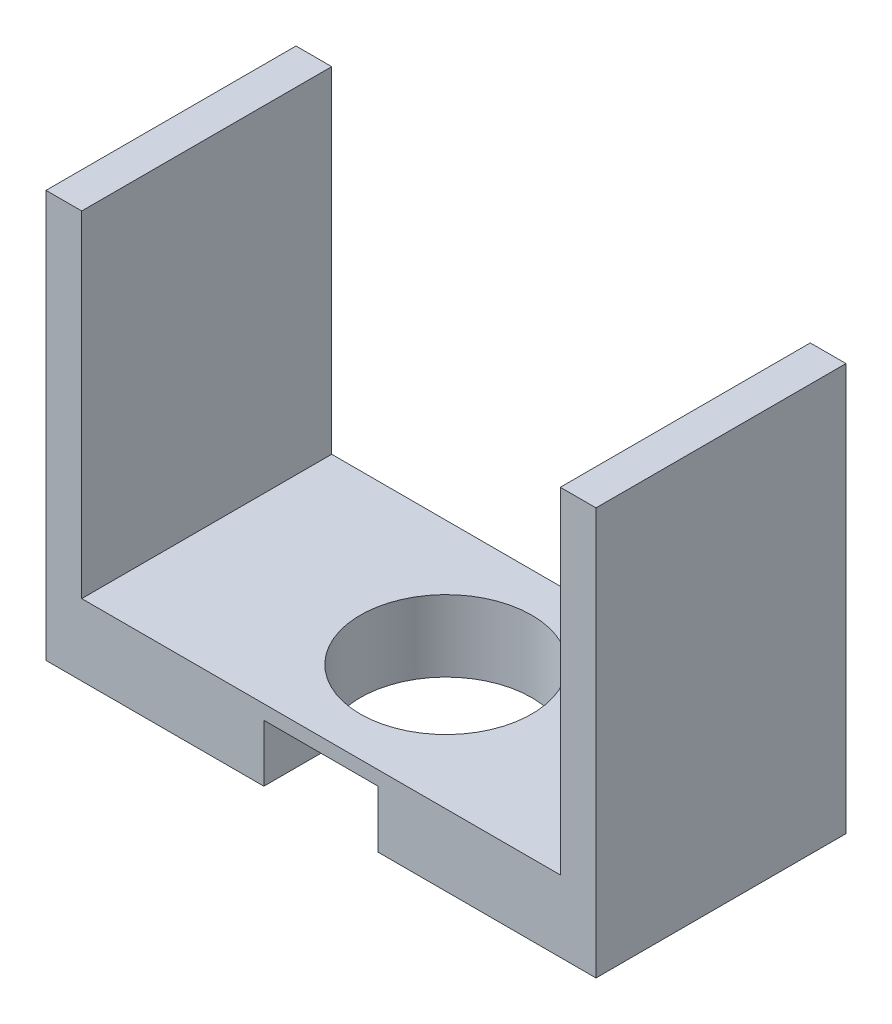
ISO-10303-21;
HEADER;
FILE_DESCRIPTION(('STEP AP214'),'2;1');
FILE_NAME('part.step','',(''),(''),'','','');
FILE_SCHEMA(('AUTOMOTIVE_DESIGN { 1 0 10303 214 1 1 1 1 }'));
ENDSEC;
DATA;
#1=APPLICATION_CONTEXT('core data for automotive mechanical design processes');
#2=APPLICATION_PROTOCOL_DEFINITION('international standard','automotive_design',2000,#1);
#3=PRODUCT_CONTEXT('',#1,'mechanical');
#4=PRODUCT('Part','Part','',(#3));
#5=PRODUCT_RELATED_PRODUCT_CATEGORY('part','',(#4));
#6=PRODUCT_DEFINITION_FORMATION('','',#4);
#7=PRODUCT_DEFINITION_CONTEXT('part definition',#1,'design');
#8=PRODUCT_DEFINITION('design','',#6,#7);
#9=PRODUCT_DEFINITION_SHAPE('','',#8);
#10=(LENGTH_UNIT() NAMED_UNIT(*) SI_UNIT(.MILLI.,.METRE.));
#11=(NAMED_UNIT(*) PLANE_ANGLE_UNIT() SI_UNIT($,.RADIAN.));
#12=(NAMED_UNIT(*) SI_UNIT($,.STERADIAN.) SOLID_ANGLE_UNIT());
#13=UNCERTAINTY_MEASURE_WITH_UNIT(LENGTH_MEASURE(1.E-05),#10,'distance_accuracy_value','');
#14=(GEOMETRIC_REPRESENTATION_CONTEXT(3) GLOBAL_UNCERTAINTY_ASSIGNED_CONTEXT((#13)) GLOBAL_UNIT_ASSIGNED_CONTEXT((#10,
#11,#12)) REPRESENTATION_CONTEXT('',''));
#15=CARTESIAN_POINT('',(0.,0.,0.));
#16=DIRECTION('',(0.,0.,1.));
#17=DIRECTION('',(1.,0.,0.));
#18=AXIS2_PLACEMENT_3D('',#15,#16,#17);
#19=CARTESIAN_POINT('',(-5.,0.,35.));
#20=DIRECTION('',(0.,-1.,0.));
#21=DIRECTION('',(0.,0.,-1.));
#22=AXIS2_PLACEMENT_3D('',#19,#20,#21);
#23=PLANE('',#22);
#24=DIRECTION('',(-1.,0.,0.));
#25=VECTOR('',#24,1.);
#26=CARTESIAN_POINT('',(-5.,0.,0.));
#27=LINE('',#26,#25);
#28=CARTESIAN_POINT('',(0.,0.,0.));
#29=VERTEX_POINT('',#28);
#30=CARTESIAN_POINT('',(-5.,0.,0.));
#31=VERTEX_POINT('',#30);
#32=EDGE_CURVE('E141',#29,#31,#27,.T.);
#33=ORIENTED_EDGE('',*,*,#32,.T.);
#34=DIRECTION('',(0.,0.,-1.));
#35=VECTOR('',#34,1.);
#36=CARTESIAN_POINT('',(-5.,0.,35.));
#37=LINE('',#36,#35);
#38=CARTESIAN_POINT('',(-5.,0.,35.));
#39=VERTEX_POINT('',#38);
#40=EDGE_CURVE('E11',#39,#31,#37,.T.);
#41=ORIENTED_EDGE('',*,*,#40,.F.);
#42=DIRECTION('',(-1.,0.,0.));
#43=VECTOR('',#42,1.);
#44=CARTESIAN_POINT('',(-5.,0.,35.));
#45=LINE('',#44,#43);
#46=CARTESIAN_POINT('',(0.,0.,35.));
#47=VERTEX_POINT('',#46);
#48=EDGE_CURVE('E156',#47,#39,#45,.T.);
#49=ORIENTED_EDGE('',*,*,#48,.F.);
#50=DIRECTION('',(0.,0.,-1.));
#51=VECTOR('',#50,1.);
#52=CARTESIAN_POINT('',(0.,0.,35.));
#53=LINE('',#52,#51);
#54=EDGE_CURVE('E137',#47,#29,#53,.T.);
#55=ORIENTED_EDGE('',*,*,#54,.T.);
#56=EDGE_LOOP('',(#33,#41,#49,#55));
#57=FACE_BOUND('',#56,.T.);
#58=ADVANCED_FACE('F31',(#57),#23,.F.);
#59=CARTESIAN_POINT('',(-4.99999999999999,-57.,35.));
#60=DIRECTION('',(1.,0.,0.));
#61=DIRECTION('',(0.,1.,0.));
#62=AXIS2_PLACEMENT_3D('',#59,#60,#61);
#63=PLANE('',#62);
#64=DIRECTION('',(0.,-1.,0.));
#65=VECTOR('',#64,1.);
#66=CARTESIAN_POINT('',(-4.99999999999999,-57.,0.));
#67=LINE('',#66,#65);
#68=CARTESIAN_POINT('',(-4.99999999999999,-57.,0.));
#69=VERTEX_POINT('',#68);
#70=EDGE_CURVE('E144',#31,#69,#67,.T.);
#71=ORIENTED_EDGE('',*,*,#70,.T.);
#72=DIRECTION('',(0.,0.,-1.));
#73=VECTOR('',#72,1.);
#74=CARTESIAN_POINT('',(-4.99999999999999,-57.,35.));
#75=LINE('',#74,#73);
#76=CARTESIAN_POINT('',(-4.99999999999999,-57.,35.));
#77=VERTEX_POINT('',#76);
#78=EDGE_CURVE('E39',#77,#69,#75,.T.);
#79=ORIENTED_EDGE('',*,*,#78,.F.);
#80=DIRECTION('',(0.,-1.,0.));
#81=VECTOR('',#80,1.);
#82=CARTESIAN_POINT('',(-4.99999999999999,-57.,35.));
#83=LINE('',#82,#81);
#84=EDGE_CURVE('E96',#39,#77,#83,.T.);
#85=ORIENTED_EDGE('',*,*,#84,.F.);
#86=ORIENTED_EDGE('',*,*,#40,.T.);
#87=EDGE_LOOP('',(#71,#79,#85,#86));
#88=FACE_BOUND('',#87,.T.);
#89=ADVANCED_FACE('F250',(#88),#63,.F.);
#90=CARTESIAN_POINT('',(-4.99999999999999,-57.,35.));
#91=DIRECTION('',(0.,1.,0.));
#92=DIRECTION('',(0.,0.,1.));
#93=AXIS2_PLACEMENT_3D('',#90,#91,#92);
#94=PLANE('',#93);
#95=CARTESIAN_POINT('',(33.5,-57.,17.5));
#96=DIRECTION('',(0.,-1.,0.));
#97=DIRECTION('',(0.,0.,-1.));
#98=AXIS2_PLACEMENT_3D('',#95,#96,#97);
#99=CIRCLE('',#98,12.);
#100=CARTESIAN_POINT('',(25.5,-57.,26.4442719099992));
#101=VERTEX_POINT('',#100);
#102=CARTESIAN_POINT('',(41.5,-57.,26.4442719099992));
#103=VERTEX_POINT('',#102);
#104=EDGE_CURVE('E193',#101,#103,#99,.T.);
#105=ORIENTED_EDGE('',*,*,#104,.F.);
#106=DIRECTION('',(0.,0.,-1.));
#107=VECTOR('',#106,1.);
#108=CARTESIAN_POINT('',(25.5,-57.,26.4442719099992));
#109=LINE('',#108,#107);
#110=CARTESIAN_POINT('',(25.5,-57.,35.));
#111=VERTEX_POINT('',#110);
#112=EDGE_CURVE('E208',#111,#101,#109,.T.);
#113=ORIENTED_EDGE('',*,*,#112,.F.);
#114=DIRECTION('',(1.,0.,0.));
#115=VECTOR('',#114,1.);
#116=CARTESIAN_POINT('',(-4.99999999999999,-57.,35.));
#117=LINE('',#116,#115);
#118=EDGE_CURVE('E174',#77,#111,#117,.T.);
#119=ORIENTED_EDGE('',*,*,#118,.F.);
#120=ORIENTED_EDGE('',*,*,#78,.T.);
#121=DIRECTION('',(1.,0.,0.));
#122=VECTOR('',#121,1.);
#123=CARTESIAN_POINT('',(-4.99999999999999,-57.,0.));
#124=LINE('',#123,#122);
#125=CARTESIAN_POINT('',(72.,-57.,0.));
#126=VERTEX_POINT('',#125);
#127=EDGE_CURVE('E146',#69,#126,#124,.T.);
#128=ORIENTED_EDGE('',*,*,#127,.T.);
#129=DIRECTION('',(0.,0.,-1.));
#130=VECTOR('',#129,1.);
#131=CARTESIAN_POINT('',(72.,-57.,35.));
#132=LINE('',#131,#130);
#133=CARTESIAN_POINT('',(72.,-57.,35.));
#134=VERTEX_POINT('',#133);
#135=EDGE_CURVE('E163',#134,#126,#132,.T.);
#136=ORIENTED_EDGE('',*,*,#135,.F.);
#137=CARTESIAN_POINT('',(41.5,-57.,35.));
#138=VERTEX_POINT('',#137);
#139=EDGE_CURVE('E190',#138,#134,#117,.T.);
#140=ORIENTED_EDGE('',*,*,#139,.F.);
#141=DIRECTION('',(0.,0.,1.));
#142=VECTOR('',#141,1.);
#143=CARTESIAN_POINT('',(41.5,-57.,26.4442719099992));
#144=LINE('',#143,#142);
#145=EDGE_CURVE('E212',#103,#138,#144,.T.);
#146=ORIENTED_EDGE('',*,*,#145,.F.);
#147=EDGE_LOOP('',(#105,#113,#119,#120,#128,#136,#140,#146));
#148=FACE_BOUND('',#147,.T.);
#149=ADVANCED_FACE('F171',(#148),#94,.F.);
#150=CARTESIAN_POINT('',(72.,-57.,35.));
#151=DIRECTION('',(-1.,0.,0.));
#152=DIRECTION('',(0.,0.,1.));
#153=AXIS2_PLACEMENT_3D('',#150,#151,#152);
#154=PLANE('',#153);
#155=DIRECTION('',(0.,1.,0.));
#156=VECTOR('',#155,1.);
#157=CARTESIAN_POINT('',(72.,-57.,0.));
#158=LINE('',#157,#156);
#159=CARTESIAN_POINT('',(72.,0.,0.));
#160=VERTEX_POINT('',#159);
#161=EDGE_CURVE('E148',#126,#160,#158,.T.);
#162=ORIENTED_EDGE('',*,*,#161,.T.);
#163=DIRECTION('',(0.,0.,-1.));
#164=VECTOR('',#163,1.);
#165=CARTESIAN_POINT('',(72.,0.,35.));
#166=LINE('',#165,#164);
#167=CARTESIAN_POINT('',(72.,0.,35.));
#168=VERTEX_POINT('',#167);
#169=EDGE_CURVE('E160',#168,#160,#166,.T.);
#170=ORIENTED_EDGE('',*,*,#169,.F.);
#171=DIRECTION('',(0.,1.,0.));
#172=VECTOR('',#171,1.);
#173=CARTESIAN_POINT('',(72.,-57.,35.));
#174=LINE('',#173,#172);
#175=EDGE_CURVE('E186',#134,#168,#174,.T.);
#176=ORIENTED_EDGE('',*,*,#175,.F.);
#177=ORIENTED_EDGE('',*,*,#135,.T.);
#178=EDGE_LOOP('',(#162,#170,#176,#177));
#179=FACE_BOUND('',#178,.T.);
#180=ADVANCED_FACE('F182',(#179),#154,.F.);
#181=CARTESIAN_POINT('',(67.,0.,35.));
#182=DIRECTION('',(0.,-1.,0.));
#183=DIRECTION('',(0.,0.,-1.));
#184=AXIS2_PLACEMENT_3D('',#181,#182,#183);
#185=PLANE('',#184);
#186=DIRECTION('',(-1.,0.,0.));
#187=VECTOR('',#186,1.);
#188=CARTESIAN_POINT('',(67.,0.,0.));
#189=LINE('',#188,#187);
#190=CARTESIAN_POINT('',(67.,0.,0.));
#191=VERTEX_POINT('',#190);
#192=EDGE_CURVE('E150',#160,#191,#189,.T.);
#193=ORIENTED_EDGE('',*,*,#192,.T.);
#194=DIRECTION('',(0.,0.,-1.));
#195=VECTOR('',#194,1.);
#196=CARTESIAN_POINT('',(67.,0.,35.));
#197=LINE('',#196,#195);
#198=CARTESIAN_POINT('',(67.,0.,35.));
#199=VERTEX_POINT('',#198);
#200=EDGE_CURVE('E132',#199,#191,#197,.T.);
#201=ORIENTED_EDGE('',*,*,#200,.F.);
#202=DIRECTION('',(-1.,0.,0.));
#203=VECTOR('',#202,1.);
#204=CARTESIAN_POINT('',(67.,0.,35.));
#205=LINE('',#204,#203);
#206=EDGE_CURVE('E120',#168,#199,#205,.T.);
#207=ORIENTED_EDGE('',*,*,#206,.F.);
#208=ORIENTED_EDGE('',*,*,#169,.T.);
#209=EDGE_LOOP('',(#193,#201,#207,#208));
#210=FACE_BOUND('',#209,.T.);
#211=ADVANCED_FACE('F185',(#210),#185,.F.);
#212=CARTESIAN_POINT('',(67.,0.,35.));
#213=DIRECTION('',(1.,0.,0.));
#214=DIRECTION('',(0.,1.,0.));
#215=AXIS2_PLACEMENT_3D('',#212,#213,#214);
#216=PLANE('',#215);
#217=DIRECTION('',(0.,-1.,0.));
#218=VECTOR('',#217,1.);
#219=CARTESIAN_POINT('',(67.,0.,0.));
#220=LINE('',#219,#218);
#221=CARTESIAN_POINT('',(67.,-47.,0.));
#222=VERTEX_POINT('',#221);
#223=EDGE_CURVE('E129',#191,#222,#220,.T.);
#224=ORIENTED_EDGE('',*,*,#223,.T.);
#225=DIRECTION('',(0.,0.,-1.));
#226=VECTOR('',#225,1.);
#227=CARTESIAN_POINT('',(67.,-47.,35.));
#228=LINE('',#227,#226);
#229=CARTESIAN_POINT('',(67.,-47.,35.));
#230=VERTEX_POINT('',#229);
#231=EDGE_CURVE('E126',#230,#222,#228,.T.);
#232=ORIENTED_EDGE('',*,*,#231,.F.);
#233=DIRECTION('',(0.,-1.,0.));
#234=VECTOR('',#233,1.);
#235=CARTESIAN_POINT('',(67.,0.,35.));
#236=LINE('',#235,#234);
#237=EDGE_CURVE('E112',#199,#230,#236,.T.);
#238=ORIENTED_EDGE('',*,*,#237,.F.);
#239=ORIENTED_EDGE('',*,*,#200,.T.);
#240=EDGE_LOOP('',(#224,#232,#238,#239));
#241=FACE_BOUND('',#240,.T.);
#242=ADVANCED_FACE('F127',(#241),#216,.F.);
#243=CARTESIAN_POINT('',(0.,-47.,35.));
#244=DIRECTION('',(0.,-1.,0.));
#245=DIRECTION('',(0.,0.,-1.));
#246=AXIS2_PLACEMENT_3D('',#243,#244,#245);
#247=PLANE('',#246);
#248=CARTESIAN_POINT('',(33.5,-47.,17.5));
#249=DIRECTION('',(0.,-1.,0.));
#250=DIRECTION('',(0.,0.,-1.));
#251=AXIS2_PLACEMENT_3D('',#248,#249,#250);
#252=CIRCLE('',#251,12.);
#253=CARTESIAN_POINT('',(33.5,-47.,5.50000000000001));
#254=VERTEX_POINT('',#253);
#255=EDGE_CURVE('E34',#254,#254,#252,.T.);
#256=ORIENTED_EDGE('',*,*,#255,.T.);
#257=EDGE_LOOP('',(#256));
#258=FACE_BOUND('',#257,.T.);
#259=DIRECTION('',(-1.,0.,0.));
#260=VECTOR('',#259,1.);
#261=CARTESIAN_POINT('',(0.,-47.,0.));
#262=LINE('',#261,#260);
#263=CARTESIAN_POINT('',(0.,-47.,0.));
#264=VERTEX_POINT('',#263);
#265=EDGE_CURVE('E153',#222,#264,#262,.T.);
#266=ORIENTED_EDGE('',*,*,#265,.T.);
#267=DIRECTION('',(0.,0.,-1.));
#268=VECTOR('',#267,1.);
#269=CARTESIAN_POINT('',(0.,-47.,35.));
#270=LINE('',#269,#268);
#271=CARTESIAN_POINT('',(0.,-47.,35.));
#272=VERTEX_POINT('',#271);
#273=EDGE_CURVE('E133',#272,#264,#270,.T.);
#274=ORIENTED_EDGE('',*,*,#273,.F.);
#275=DIRECTION('',(-1.,0.,0.));
#276=VECTOR('',#275,1.);
#277=CARTESIAN_POINT('',(0.,-47.,35.));
#278=LINE('',#277,#276);
#279=EDGE_CURVE('E117',#230,#272,#278,.T.);
#280=ORIENTED_EDGE('',*,*,#279,.F.);
#281=ORIENTED_EDGE('',*,*,#231,.T.);
#282=EDGE_LOOP('',(#266,#274,#280,#281));
#283=FACE_BOUND('',#282,.T.);
#284=ADVANCED_FACE('F135',(#258,#283),#247,.F.);
#285=CARTESIAN_POINT('',(0.,0.,35.));
#286=DIRECTION('',(-1.,0.,0.));
#287=DIRECTION('',(0.,-1.,0.));
#288=AXIS2_PLACEMENT_3D('',#285,#286,#287);
#289=PLANE('',#288);
#290=DIRECTION('',(0.,1.,0.));
#291=VECTOR('',#290,1.);
#292=CARTESIAN_POINT('',(0.,0.,0.));
#293=LINE('',#292,#291);
#294=EDGE_CURVE('E88',#264,#29,#293,.T.);
#295=ORIENTED_EDGE('',*,*,#294,.T.);
#296=ORIENTED_EDGE('',*,*,#54,.F.);
#297=DIRECTION('',(0.,1.,0.));
#298=VECTOR('',#297,1.);
#299=CARTESIAN_POINT('',(0.,0.,35.));
#300=LINE('',#299,#298);
#301=EDGE_CURVE('E55',#272,#47,#300,.T.);
#302=ORIENTED_EDGE('',*,*,#301,.F.);
#303=ORIENTED_EDGE('',*,*,#273,.T.);
#304=EDGE_LOOP('',(#295,#296,#302,#303));
#305=FACE_BOUND('',#304,.T.);
#306=ADVANCED_FACE('F266',(#305),#289,.F.);
#307=CARTESIAN_POINT('',(0.,0.,35.));
#308=DIRECTION('',(0.,0.,-1.));
#309=DIRECTION('',(-1.,0.,0.));
#310=AXIS2_PLACEMENT_3D('',#307,#308,#309);
#311=PLANE('',#310);
#312=ORIENTED_EDGE('',*,*,#118,.T.);
#313=DIRECTION('',(0.,-1.,0.));
#314=VECTOR('',#313,1.);
#315=CARTESIAN_POINT('',(25.5,-49.,35.));
#316=LINE('',#315,#314);
#317=CARTESIAN_POINT('',(25.5,-49.,35.));
#318=VERTEX_POINT('',#317);
#319=EDGE_CURVE('E203',#318,#111,#316,.T.);
#320=ORIENTED_EDGE('',*,*,#319,.F.);
#321=DIRECTION('',(-1.,0.,0.));
#322=VECTOR('',#321,1.);
#323=CARTESIAN_POINT('',(25.5,-49.,35.));
#324=LINE('',#323,#322);
#325=CARTESIAN_POINT('',(41.5,-49.,35.));
#326=VERTEX_POINT('',#325);
#327=EDGE_CURVE('E216',#326,#318,#324,.T.);
#328=ORIENTED_EDGE('',*,*,#327,.F.);
#329=DIRECTION('',(0.,-1.,0.));
#330=VECTOR('',#329,1.);
#331=CARTESIAN_POINT('',(41.5,-49.,35.));
#332=LINE('',#331,#330);
#333=EDGE_CURVE('E200',#326,#138,#332,.T.);
#334=ORIENTED_EDGE('',*,*,#333,.T.);
#335=ORIENTED_EDGE('',*,*,#139,.T.);
#336=ORIENTED_EDGE('',*,*,#175,.T.);
#337=ORIENTED_EDGE('',*,*,#206,.T.);
#338=ORIENTED_EDGE('',*,*,#237,.T.);
#339=ORIENTED_EDGE('',*,*,#279,.T.);
#340=ORIENTED_EDGE('',*,*,#301,.T.);
#341=ORIENTED_EDGE('',*,*,#48,.T.);
#342=ORIENTED_EDGE('',*,*,#84,.T.);
#343=EDGE_LOOP('',(#312,#320,#328,#334,#335,#336,#337,#338,#339,#340,#341,#342));
#344=FACE_BOUND('',#343,.T.);
#345=ADVANCED_FACE('F115',(#344),#311,.F.);
#346=CARTESIAN_POINT('',(0.,0.,0.));
#347=DIRECTION('',(0.,0.,-1.));
#348=DIRECTION('',(-1.,0.,0.));
#349=AXIS2_PLACEMENT_3D('',#346,#347,#348);
#350=PLANE('',#349);
#351=ORIENTED_EDGE('',*,*,#32,.F.);
#352=ORIENTED_EDGE('',*,*,#294,.F.);
#353=ORIENTED_EDGE('',*,*,#265,.F.);
#354=ORIENTED_EDGE('',*,*,#223,.F.);
#355=ORIENTED_EDGE('',*,*,#192,.F.);
#356=ORIENTED_EDGE('',*,*,#161,.F.);
#357=ORIENTED_EDGE('',*,*,#127,.F.);
#358=ORIENTED_EDGE('',*,*,#70,.F.);
#359=EDGE_LOOP('',(#351,#352,#353,#354,#355,#356,#357,#358));
#360=FACE_BOUND('',#359,.T.);
#361=ADVANCED_FACE('F178',(#360),#350,.T.);
#362=CARTESIAN_POINT('',(33.5,0.,17.5));
#363=DIRECTION('',(0.,-1.,0.));
#364=DIRECTION('',(0.,0.,-1.));
#365=AXIS2_PLACEMENT_3D('',#362,#363,#364);
#366=CYLINDRICAL_SURFACE('',#365,12.);
#367=CARTESIAN_POINT('',(33.5,-49.,17.5));
#368=DIRECTION('',(0.,1.,0.));
#369=DIRECTION('',(0.,0.,-1.));
#370=AXIS2_PLACEMENT_3D('',#367,#368,#369);
#371=CIRCLE('',#370,12.);
#372=CARTESIAN_POINT('',(25.5,-49.,26.4442719099992));
#373=VERTEX_POINT('',#372);
#374=CARTESIAN_POINT('',(41.5,-49.,26.4442719099992));
#375=VERTEX_POINT('',#374);
#376=EDGE_CURVE('E211',#373,#375,#371,.T.);
#377=ORIENTED_EDGE('',*,*,#376,.F.);
#378=DIRECTION('',(0.,-1.,0.));
#379=VECTOR('',#378,1.);
#380=CARTESIAN_POINT('',(25.5,-49.,26.4442719099992));
#381=LINE('',#380,#379);
#382=EDGE_CURVE('E196',#373,#101,#381,.T.);
#383=ORIENTED_EDGE('',*,*,#382,.T.);
#384=ORIENTED_EDGE('',*,*,#104,.T.);
#385=DIRECTION('',(0.,-1.,0.));
#386=VECTOR('',#385,1.);
#387=CARTESIAN_POINT('',(41.5,-49.,26.4442719099992));
#388=LINE('',#387,#386);
#389=EDGE_CURVE('E197',#375,#103,#388,.T.);
#390=ORIENTED_EDGE('',*,*,#389,.F.);
#391=EDGE_LOOP('',(#377,#383,#384,#390));
#392=FACE_BOUND('',#391,.T.);
#393=ORIENTED_EDGE('',*,*,#255,.F.);
#394=EDGE_LOOP('',(#393));
#395=FACE_BOUND('',#394,.T.);
#396=ADVANCED_FACE('F230',(#392,#395),#366,.F.);
#397=CARTESIAN_POINT('',(25.5,-49.,26.4442719099992));
#398=DIRECTION('',(-1.,0.,0.));
#399=DIRECTION('',(0.,0.,1.));
#400=AXIS2_PLACEMENT_3D('',#397,#398,#399);
#401=PLANE('',#400);
#402=ORIENTED_EDGE('',*,*,#112,.T.);
#403=ORIENTED_EDGE('',*,*,#382,.F.);
#404=DIRECTION('',(0.,0.,-1.));
#405=VECTOR('',#404,1.);
#406=CARTESIAN_POINT('',(25.5,-49.,26.4442719099992));
#407=LINE('',#406,#405);
#408=EDGE_CURVE('E46',#318,#373,#407,.T.);
#409=ORIENTED_EDGE('',*,*,#408,.F.);
#410=ORIENTED_EDGE('',*,*,#319,.T.);
#411=EDGE_LOOP('',(#402,#403,#409,#410));
#412=FACE_BOUND('',#411,.T.);
#413=ADVANCED_FACE('F246',(#412),#401,.F.);
#414=CARTESIAN_POINT('',(41.5,-49.,26.4442719099992));
#415=DIRECTION('',(1.,0.,0.));
#416=DIRECTION('',(0.,0.,-1.));
#417=AXIS2_PLACEMENT_3D('',#414,#415,#416);
#418=PLANE('',#417);
#419=ORIENTED_EDGE('',*,*,#145,.T.);
#420=ORIENTED_EDGE('',*,*,#333,.F.);
#421=DIRECTION('',(0.,0.,1.));
#422=VECTOR('',#421,1.);
#423=CARTESIAN_POINT('',(41.5,-49.,26.4442719099992));
#424=LINE('',#423,#422);
#425=EDGE_CURVE('E218',#375,#326,#424,.T.);
#426=ORIENTED_EDGE('',*,*,#425,.F.);
#427=ORIENTED_EDGE('',*,*,#389,.T.);
#428=EDGE_LOOP('',(#419,#420,#426,#427));
#429=FACE_BOUND('',#428,.T.);
#430=ADVANCED_FACE('F235',(#429),#418,.F.);
#431=CARTESIAN_POINT('',(33.5,-49.,17.5));
#432=DIRECTION('',(0.,-1.,0.));
#433=DIRECTION('',(0.,0.,-1.));
#434=AXIS2_PLACEMENT_3D('',#431,#432,#433);
#435=PLANE('',#434);
#436=ORIENTED_EDGE('',*,*,#376,.T.);
#437=ORIENTED_EDGE('',*,*,#425,.T.);
#438=ORIENTED_EDGE('',*,*,#327,.T.);
#439=ORIENTED_EDGE('',*,*,#408,.T.);
#440=EDGE_LOOP('',(#436,#437,#438,#439));
#441=FACE_BOUND('',#440,.T.);
#442=ADVANCED_FACE('F224',(#441),#435,.T.);
#443=CLOSED_SHELL('',(#58,#89,#149,#180,#211,#242,#284,#306,#345,#361,#396,#413,#430,#442));
#444=MANIFOLD_SOLID_BREP('B2',#443);
#445=ADVANCED_BREP_SHAPE_REPRESENTATION('',(#18,#444),#14);
#446=SHAPE_DEFINITION_REPRESENTATION(#9,#445);
ENDSEC;
END-ISO-10303-21;
